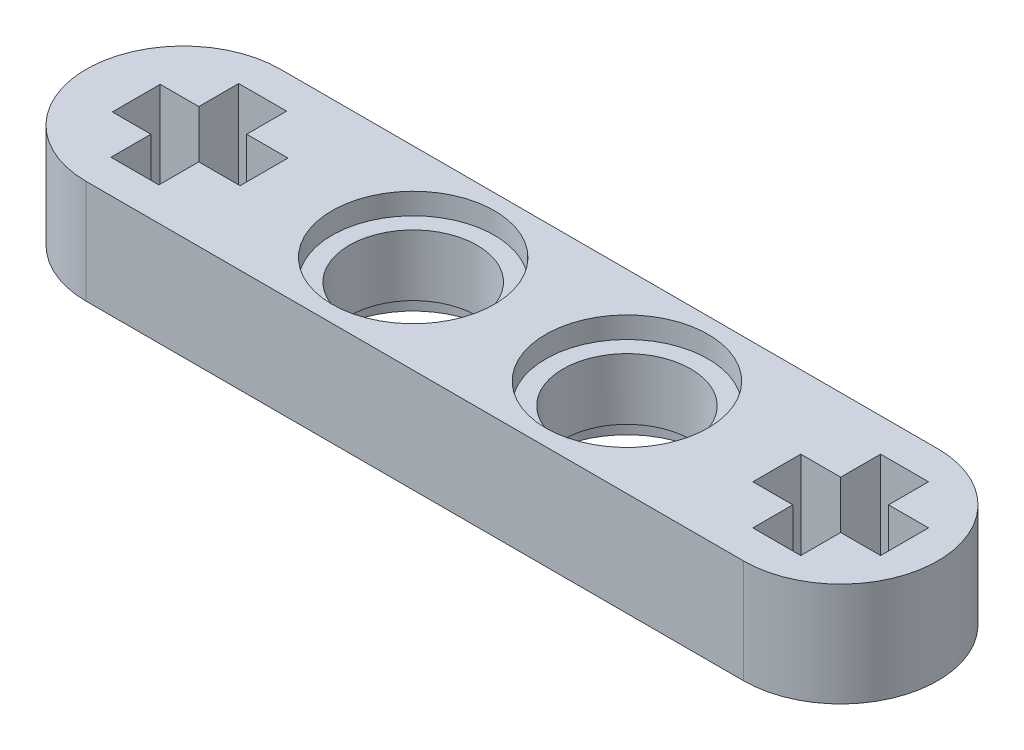
ISO-10303-21;
HEADER;
FILE_DESCRIPTION(('STEP AP214'),'2;1');
FILE_NAME('part.step','',(''),(''),'','','');
FILE_SCHEMA(('AUTOMOTIVE_DESIGN { 1 0 10303 214 1 1 1 1 }'));
ENDSEC;
DATA;
#1=APPLICATION_CONTEXT('core data for automotive mechanical design processes');
#2=APPLICATION_PROTOCOL_DEFINITION('international standard','automotive_design',2000,#1);
#3=PRODUCT_CONTEXT('',#1,'mechanical');
#4=PRODUCT('Part','Part','',(#3));
#5=PRODUCT_RELATED_PRODUCT_CATEGORY('part','',(#4));
#6=PRODUCT_DEFINITION_FORMATION('','',#4);
#7=PRODUCT_DEFINITION_CONTEXT('part definition',#1,'design');
#8=PRODUCT_DEFINITION('design','',#6,#7);
#9=PRODUCT_DEFINITION_SHAPE('','',#8);
#10=(LENGTH_UNIT() NAMED_UNIT(*) SI_UNIT(.MILLI.,.METRE.));
#11=(NAMED_UNIT(*) PLANE_ANGLE_UNIT() SI_UNIT($,.RADIAN.));
#12=(NAMED_UNIT(*) SI_UNIT($,.STERADIAN.) SOLID_ANGLE_UNIT());
#13=UNCERTAINTY_MEASURE_WITH_UNIT(LENGTH_MEASURE(1.E-05),#10,'distance_accuracy_value','');
#14=(GEOMETRIC_REPRESENTATION_CONTEXT(3) GLOBAL_UNCERTAINTY_ASSIGNED_CONTEXT((#13)) GLOBAL_UNIT_ASSIGNED_CONTEXT((#10,
#11,#12)) REPRESENTATION_CONTEXT('',''));
#15=CARTESIAN_POINT('',(0.,0.,0.));
#16=DIRECTION('',(0.,0.,1.));
#17=DIRECTION('',(1.,0.,0.));
#18=AXIS2_PLACEMENT_3D('',#15,#16,#17);
#19=CARTESIAN_POINT('',(-4.045,3.9,-0.0180082217721821));
#20=DIRECTION('',(0.,-1.,0.));
#21=DIRECTION('',(0.,0.,-1.));
#22=AXIS2_PLACEMENT_3D('',#19,#20,#21);
#23=CYLINDRICAL_SURFACE('',#22,2.4);
#24=CARTESIAN_POINT('',(-4.045,3.1,-0.0180082217721821));
#25=DIRECTION('',(0.,1.,0.));
#26=DIRECTION('',(0.,0.,1.));
#27=AXIS2_PLACEMENT_3D('',#24,#25,#26);
#28=CIRCLE('',#27,2.4);
#29=CARTESIAN_POINT('',(-4.045,3.1,2.38199177822782));
#30=VERTEX_POINT('',#29);
#31=EDGE_CURVE('E273',#30,#30,#28,.T.);
#32=ORIENTED_EDGE('',*,*,#31,.T.);
#33=EDGE_LOOP('',(#32));
#34=FACE_BOUND('',#33,.T.);
#35=CARTESIAN_POINT('',(-4.045,0.8,-0.0180082217721821));
#36=DIRECTION('',(0.,-1.,0.));
#37=DIRECTION('',(0.,0.,-1.));
#38=AXIS2_PLACEMENT_3D('',#35,#36,#37);
#39=CIRCLE('',#38,2.4);
#40=CARTESIAN_POINT('',(-4.045,0.8,-2.41800822177218));
#41=VERTEX_POINT('',#40);
#42=EDGE_CURVE('E43',#41,#41,#39,.T.);
#43=ORIENTED_EDGE('',*,*,#42,.T.);
#44=EDGE_LOOP('',(#43));
#45=FACE_BOUND('',#44,.T.);
#46=ADVANCED_FACE('F39',(#34,#45),#23,.F.);
#47=CARTESIAN_POINT('',(3.995,3.9,-0.00827061217611125));
#48=DIRECTION('',(0.,-1.,0.));
#49=DIRECTION('',(0.,0.,-1.));
#50=AXIS2_PLACEMENT_3D('',#47,#48,#49);
#51=CYLINDRICAL_SURFACE('',#50,2.4);
#52=CARTESIAN_POINT('',(3.995,3.1,-0.00827061217611125));
#53=DIRECTION('',(0.,1.,0.));
#54=DIRECTION('',(0.,0.,1.));
#55=AXIS2_PLACEMENT_3D('',#52,#53,#54);
#56=CIRCLE('',#55,2.4);
#57=CARTESIAN_POINT('',(3.995,3.1,2.39172938782389));
#58=VERTEX_POINT('',#57);
#59=EDGE_CURVE('E435',#58,#58,#56,.T.);
#60=ORIENTED_EDGE('',*,*,#59,.T.);
#61=EDGE_LOOP('',(#60));
#62=FACE_BOUND('',#61,.T.);
#63=CARTESIAN_POINT('',(3.995,0.8,-0.00827061217611125));
#64=DIRECTION('',(0.,-1.,0.));
#65=DIRECTION('',(0.,0.,-1.));
#66=AXIS2_PLACEMENT_3D('',#63,#64,#65);
#67=CIRCLE('',#66,2.4);
#68=CARTESIAN_POINT('',(3.995,0.8,-2.40827061217611));
#69=VERTEX_POINT('',#68);
#70=EDGE_CURVE('E440',#69,#69,#67,.T.);
#71=ORIENTED_EDGE('',*,*,#70,.T.);
#72=EDGE_LOOP('',(#71));
#73=FACE_BOUND('',#72,.T.);
#74=ADVANCED_FACE('F475',(#62,#73),#51,.F.);
#75=CARTESIAN_POINT('',(-12.665,3.9,0.));
#76=DIRECTION('',(0.,1.,0.));
#77=DIRECTION('',(0.,0.,1.));
#78=AXIS2_PLACEMENT_3D('',#75,#76,#77);
#79=PLANE('',#78);
#80=CARTESIAN_POINT('',(-4.045,3.9,-0.0180082217721821));
#81=DIRECTION('',(0.,1.,0.));
#82=DIRECTION('',(0.,0.,1.));
#83=AXIS2_PLACEMENT_3D('',#80,#81,#82);
#84=CIRCLE('',#83,3.05);
#85=CARTESIAN_POINT('',(-4.045,3.9,3.03199177822782));
#86=VERTEX_POINT('',#85);
#87=EDGE_CURVE('E463',#86,#86,#84,.T.);
#88=ORIENTED_EDGE('',*,*,#87,.F.);
#89=EDGE_LOOP('',(#88));
#90=FACE_BOUND('',#89,.T.);
#91=CARTESIAN_POINT('',(3.995,3.9,-0.00827061217611125));
#92=DIRECTION('',(0.,1.,0.));
#93=DIRECTION('',(0.,0.,1.));
#94=AXIS2_PLACEMENT_3D('',#91,#92,#93);
#95=CIRCLE('',#94,3.05);
#96=CARTESIAN_POINT('',(3.995,3.9,3.04172938782389));
#97=VERTEX_POINT('',#96);
#98=EDGE_CURVE('E446',#97,#97,#95,.T.);
#99=ORIENTED_EDGE('',*,*,#98,.F.);
#100=EDGE_LOOP('',(#99));
#101=FACE_BOUND('',#100,.T.);
#102=DIRECTION('',(1.,0.,0.));
#103=VECTOR('',#102,1.);
#104=CARTESIAN_POINT('',(-9.63306020227232,3.9,0.898912155858764));
#105=LINE('',#104,#103);
#106=CARTESIAN_POINT('',(-11.1849999999999,3.9,0.898912155858748));
#107=VERTEX_POINT('',#106);
#108=CARTESIAN_POINT('',(-9.63306020227232,3.9,0.898912155858764));
#109=VERTEX_POINT('',#108);
#110=EDGE_CURVE('E234',#107,#109,#105,.T.);
#111=ORIENTED_EDGE('',*,*,#110,.F.);
#112=DIRECTION('',(0.,0.,-1.));
#113=VECTOR('',#112,1.);
#114=CARTESIAN_POINT('',(-11.1849999999999,3.9,0.898912155858748));
#115=LINE('',#114,#113);
#116=CARTESIAN_POINT('',(-11.1849999999999,3.9,2.39891215586455));
#117=VERTEX_POINT('',#116);
#118=EDGE_CURVE('E226',#117,#107,#115,.T.);
#119=ORIENTED_EDGE('',*,*,#118,.F.);
#120=DIRECTION('',(1.,0.,0.));
#121=VECTOR('',#120,1.);
#122=CARTESIAN_POINT('',(-12.9850000000001,3.9,2.39891215586455));
#123=LINE('',#122,#121);
#124=CARTESIAN_POINT('',(-12.9850000000001,3.9,2.39891215586455));
#125=VERTEX_POINT('',#124);
#126=EDGE_CURVE('E270',#125,#117,#123,.T.);
#127=ORIENTED_EDGE('',*,*,#126,.F.);
#128=DIRECTION('',(0.,0.,1.));
#129=VECTOR('',#128,1.);
#130=CARTESIAN_POINT('',(-12.9850000000001,3.9,0.898912155858747));
#131=LINE('',#130,#129);
#132=CARTESIAN_POINT('',(-12.9850000000001,3.9,0.898912155858747));
#133=VERTEX_POINT('',#132);
#134=EDGE_CURVE('E268',#133,#125,#131,.T.);
#135=ORIENTED_EDGE('',*,*,#134,.F.);
#136=DIRECTION('',(1.,0.,0.));
#137=VECTOR('',#136,1.);
#138=CARTESIAN_POINT('',(-12.9850000000001,3.9,0.898912155858747));
#139=LINE('',#138,#137);
#140=CARTESIAN_POINT('',(-14.4330602022723,3.9,0.898912155858765));
#141=VERTEX_POINT('',#140);
#142=EDGE_CURVE('E266',#141,#133,#139,.T.);
#143=ORIENTED_EDGE('',*,*,#142,.F.);
#144=DIRECTION('',(0.,0.,1.));
#145=VECTOR('',#144,1.);
#146=CARTESIAN_POINT('',(-14.4330602022723,3.9,0.898912155858765));
#147=LINE('',#146,#145);
#148=CARTESIAN_POINT('',(-14.4330602022723,3.9,-0.901087844141502));
#149=VERTEX_POINT('',#148);
#150=EDGE_CURVE('E264',#149,#141,#147,.T.);
#151=ORIENTED_EDGE('',*,*,#150,.F.);
#152=DIRECTION('',(-1.,0.,0.));
#153=VECTOR('',#152,1.);
#154=CARTESIAN_POINT('',(-12.9850000000001,3.9,-0.901087844141502));
#155=LINE('',#154,#153);
#156=CARTESIAN_POINT('',(-12.9850000000001,3.9,-0.901087844141502));
#157=VERTEX_POINT('',#156);
#158=EDGE_CURVE('E262',#157,#149,#155,.T.);
#159=ORIENTED_EDGE('',*,*,#158,.F.);
#160=DIRECTION('',(0.,0.,1.));
#161=VECTOR('',#160,1.);
#162=CARTESIAN_POINT('',(-12.9850000000001,3.9,-2.40108784413312));
#163=LINE('',#162,#161);
#164=CARTESIAN_POINT('',(-12.9850000000001,3.9,-2.40108784413312));
#165=VERTEX_POINT('',#164);
#166=EDGE_CURVE('E260',#165,#157,#163,.T.);
#167=ORIENTED_EDGE('',*,*,#166,.F.);
#168=DIRECTION('',(-1.,0.,0.));
#169=VECTOR('',#168,1.);
#170=CARTESIAN_POINT('',(-12.9850000000001,3.9,-2.40108784413312));
#171=LINE('',#170,#169);
#172=CARTESIAN_POINT('',(-11.1849999999999,3.9,-2.40108784413312));
#173=VERTEX_POINT('',#172);
#174=EDGE_CURVE('E258',#173,#165,#171,.T.);
#175=ORIENTED_EDGE('',*,*,#174,.F.);
#176=DIRECTION('',(0.,0.,-1.));
#177=VECTOR('',#176,1.);
#178=CARTESIAN_POINT('',(-11.1849999999999,3.9,-2.40108784413312));
#179=LINE('',#178,#177);
#180=CARTESIAN_POINT('',(-11.1849999999999,3.9,-0.901087844141505));
#181=VERTEX_POINT('',#180);
#182=EDGE_CURVE('E256',#181,#173,#179,.T.);
#183=ORIENTED_EDGE('',*,*,#182,.F.);
#184=DIRECTION('',(-1.,0.,0.));
#185=VECTOR('',#184,1.);
#186=CARTESIAN_POINT('',(-9.63306020227232,3.9,-0.901087844141502));
#187=LINE('',#186,#185);
#188=CARTESIAN_POINT('',(-9.63306020227232,3.9,-0.901087844141502));
#189=VERTEX_POINT('',#188);
#190=EDGE_CURVE('E251',#189,#181,#187,.T.);
#191=ORIENTED_EDGE('',*,*,#190,.F.);
#192=DIRECTION('',(0.,0.,-1.));
#193=VECTOR('',#192,1.);
#194=CARTESIAN_POINT('',(-9.63306020227232,3.9,0.898912155858764));
#195=LINE('',#194,#193);
#196=EDGE_CURVE('E249',#109,#189,#195,.T.);
#197=ORIENTED_EDGE('',*,*,#196,.F.);
#198=EDGE_LOOP('',(#111,#119,#127,#135,#143,#151,#159,#167,#175,#183,#191,#197));
#199=FACE_BOUND('',#198,.T.);
#200=DIRECTION('',(1.,0.,0.));
#201=VECTOR('',#200,1.);
#202=CARTESIAN_POINT('',(14.435,3.9,0.9));
#203=LINE('',#202,#201);
#204=CARTESIAN_POINT('',(12.935,3.9,0.9));
#205=VERTEX_POINT('',#204);
#206=CARTESIAN_POINT('',(14.435,3.9,0.9));
#207=VERTEX_POINT('',#206);
#208=EDGE_CURVE('E325',#205,#207,#203,.T.);
#209=ORIENTED_EDGE('',*,*,#208,.F.);
#210=DIRECTION('',(0.,0.,-1.));
#211=VECTOR('',#210,1.);
#212=CARTESIAN_POINT('',(12.935,3.9,0.9));
#213=LINE('',#212,#211);
#214=CARTESIAN_POINT('',(12.935,3.9,2.4));
#215=VERTEX_POINT('',#214);
#216=EDGE_CURVE('E323',#215,#205,#213,.T.);
#217=ORIENTED_EDGE('',*,*,#216,.F.);
#218=DIRECTION('',(1.,0.,0.));
#219=VECTOR('',#218,1.);
#220=CARTESIAN_POINT('',(11.135,3.9,2.4));
#221=LINE('',#220,#219);
#222=CARTESIAN_POINT('',(11.135,3.9,2.4));
#223=VERTEX_POINT('',#222);
#224=EDGE_CURVE('E347',#223,#215,#221,.T.);
#225=ORIENTED_EDGE('',*,*,#224,.F.);
#226=DIRECTION('',(0.,0.,1.));
#227=VECTOR('',#226,1.);
#228=CARTESIAN_POINT('',(11.135,3.9,0.9));
#229=LINE('',#228,#227);
#230=CARTESIAN_POINT('',(11.135,3.9,0.9));
#231=VERTEX_POINT('',#230);
#232=EDGE_CURVE('E344',#231,#223,#229,.T.);
#233=ORIENTED_EDGE('',*,*,#232,.F.);
#234=DIRECTION('',(1.,0.,0.));
#235=VECTOR('',#234,1.);
#236=CARTESIAN_POINT('',(11.135,3.9,0.9));
#237=LINE('',#236,#235);
#238=CARTESIAN_POINT('',(9.63499999999998,3.9,0.900000000000001));
#239=VERTEX_POINT('',#238);
#240=EDGE_CURVE('E342',#239,#231,#237,.T.);
#241=ORIENTED_EDGE('',*,*,#240,.F.);
#242=DIRECTION('',(0.,0.,1.));
#243=VECTOR('',#242,1.);
#244=CARTESIAN_POINT('',(9.63499999999998,3.9,0.900000000000001));
#245=LINE('',#244,#243);
#246=CARTESIAN_POINT('',(9.63500000000002,3.9,-0.9));
#247=VERTEX_POINT('',#246);
#248=EDGE_CURVE('E340',#247,#239,#245,.T.);
#249=ORIENTED_EDGE('',*,*,#248,.F.);
#250=DIRECTION('',(-1.,0.,0.));
#251=VECTOR('',#250,1.);
#252=CARTESIAN_POINT('',(11.135,3.9,-0.900000000000001));
#253=LINE('',#252,#251);
#254=CARTESIAN_POINT('',(11.135,3.9,-0.900000000000001));
#255=VERTEX_POINT('',#254);
#256=EDGE_CURVE('E338',#255,#247,#253,.T.);
#257=ORIENTED_EDGE('',*,*,#256,.F.);
#258=DIRECTION('',(0.,0.,1.));
#259=VECTOR('',#258,1.);
#260=CARTESIAN_POINT('',(11.135,3.9,-2.4));
#261=LINE('',#260,#259);
#262=CARTESIAN_POINT('',(11.135,3.9,-2.4));
#263=VERTEX_POINT('',#262);
#264=EDGE_CURVE('E336',#263,#255,#261,.T.);
#265=ORIENTED_EDGE('',*,*,#264,.F.);
#266=DIRECTION('',(-1.,0.,0.));
#267=VECTOR('',#266,1.);
#268=CARTESIAN_POINT('',(11.135,3.9,-2.4));
#269=LINE('',#268,#267);
#270=CARTESIAN_POINT('',(12.935,3.9,-2.4));
#271=VERTEX_POINT('',#270);
#272=EDGE_CURVE('E334',#271,#263,#269,.T.);
#273=ORIENTED_EDGE('',*,*,#272,.F.);
#274=DIRECTION('',(0.,0.,-1.));
#275=VECTOR('',#274,1.);
#276=CARTESIAN_POINT('',(12.935,3.9,-2.4));
#277=LINE('',#276,#275);
#278=CARTESIAN_POINT('',(12.935,3.9,-0.900000000000002));
#279=VERTEX_POINT('',#278);
#280=EDGE_CURVE('E332',#279,#271,#277,.T.);
#281=ORIENTED_EDGE('',*,*,#280,.F.);
#282=DIRECTION('',(-1.,0.,0.));
#283=VECTOR('',#282,1.);
#284=CARTESIAN_POINT('',(14.435,3.9,-0.900000000000003));
#285=LINE('',#284,#283);
#286=CARTESIAN_POINT('',(14.435,3.9,-0.900000000000003));
#287=VERTEX_POINT('',#286);
#288=EDGE_CURVE('E330',#287,#279,#285,.T.);
#289=ORIENTED_EDGE('',*,*,#288,.F.);
#290=DIRECTION('',(0.,0.,-1.));
#291=VECTOR('',#290,1.);
#292=CARTESIAN_POINT('',(14.435,3.9,0.9));
#293=LINE('',#292,#291);
#294=EDGE_CURVE('E328',#207,#287,#293,.T.);
#295=ORIENTED_EDGE('',*,*,#294,.F.);
#296=EDGE_LOOP('',(#209,#217,#225,#233,#241,#249,#257,#265,#273,#281,#289,#295));
#297=FACE_BOUND('',#296,.T.);
#298=CARTESIAN_POINT('',(-12.665,3.9,0.));
#299=DIRECTION('',(0.,1.,0.));
#300=DIRECTION('',(0.,0.,1.));
#301=AXIS2_PLACEMENT_3D('',#298,#299,#300);
#302=CIRCLE('',#301,3.65);
#303=CARTESIAN_POINT('',(-12.665,3.9,-3.65));
#304=VERTEX_POINT('',#303);
#305=CARTESIAN_POINT('',(-12.665,3.9,3.65));
#306=VERTEX_POINT('',#305);
#307=EDGE_CURVE('E410',#304,#306,#302,.T.);
#308=ORIENTED_EDGE('',*,*,#307,.T.);
#309=DIRECTION('',(1.,0.,0.));
#310=VECTOR('',#309,1.);
#311=CARTESIAN_POINT('',(-12.665,3.9,3.65));
#312=LINE('',#311,#310);
#313=CARTESIAN_POINT('',(12.035,3.9,3.65));
#314=VERTEX_POINT('',#313);
#315=EDGE_CURVE('E413',#306,#314,#312,.T.);
#316=ORIENTED_EDGE('',*,*,#315,.T.);
#317=CARTESIAN_POINT('',(12.035,3.9,0.));
#318=DIRECTION('',(0.,1.,0.));
#319=DIRECTION('',(0.,0.,1.));
#320=AXIS2_PLACEMENT_3D('',#317,#318,#319);
#321=CIRCLE('',#320,3.65);
#322=CARTESIAN_POINT('',(12.035,3.9,-3.65));
#323=VERTEX_POINT('',#322);
#324=EDGE_CURVE('E416',#314,#323,#321,.T.);
#325=ORIENTED_EDGE('',*,*,#324,.T.);
#326=DIRECTION('',(-1.,0.,0.));
#327=VECTOR('',#326,1.);
#328=CARTESIAN_POINT('',(-12.665,3.9,-3.65));
#329=LINE('',#328,#327);
#330=EDGE_CURVE('E418',#323,#304,#329,.T.);
#331=ORIENTED_EDGE('',*,*,#330,.T.);
#332=EDGE_LOOP('',(#308,#316,#325,#331));
#333=FACE_BOUND('',#332,.T.);
#334=ADVANCED_FACE('F246',(#90,#101,#199,#297,#333),#79,.T.);
#335=CARTESIAN_POINT('',(-12.665,0.,0.));
#336=DIRECTION('',(0.,1.,0.));
#337=DIRECTION('',(0.,0.,1.));
#338=AXIS2_PLACEMENT_3D('',#335,#336,#337);
#339=PLANE('',#338);
#340=CARTESIAN_POINT('',(3.995,0.,-0.00827061217611125));
#341=DIRECTION('',(0.,-1.,0.));
#342=DIRECTION('',(0.,0.,-1.));
#343=AXIS2_PLACEMENT_3D('',#340,#341,#342);
#344=CIRCLE('',#343,3.05);
#345=CARTESIAN_POINT('',(3.995,0.,-3.05827061217611));
#346=VERTEX_POINT('',#345);
#347=EDGE_CURVE('E448',#346,#346,#344,.T.);
#348=ORIENTED_EDGE('',*,*,#347,.F.);
#349=EDGE_LOOP('',(#348));
#350=FACE_BOUND('',#349,.T.);
#351=CARTESIAN_POINT('',(-4.045,0.,-0.0180082217721821));
#352=DIRECTION('',(0.,-1.,0.));
#353=DIRECTION('',(0.,0.,-1.));
#354=AXIS2_PLACEMENT_3D('',#351,#352,#353);
#355=CIRCLE('',#354,3.05);
#356=CARTESIAN_POINT('',(-4.045,0.,-3.06800822177218));
#357=VERTEX_POINT('',#356);
#358=EDGE_CURVE('E458',#357,#357,#355,.T.);
#359=ORIENTED_EDGE('',*,*,#358,.F.);
#360=EDGE_LOOP('',(#359));
#361=FACE_BOUND('',#360,.T.);
#362=DIRECTION('',(0.,0.,-1.));
#363=VECTOR('',#362,1.);
#364=CARTESIAN_POINT('',(12.935,0.,0.9));
#365=LINE('',#364,#363);
#366=CARTESIAN_POINT('',(12.935,0.,2.4));
#367=VERTEX_POINT('',#366);
#368=CARTESIAN_POINT('',(12.935,0.,0.9));
#369=VERTEX_POINT('',#368);
#370=EDGE_CURVE('E242',#367,#369,#365,.T.);
#371=ORIENTED_EDGE('',*,*,#370,.T.);
#372=DIRECTION('',(1.,0.,0.));
#373=VECTOR('',#372,1.);
#374=CARTESIAN_POINT('',(14.435,0.,0.9));
#375=LINE('',#374,#373);
#376=CARTESIAN_POINT('',(14.435,0.,0.9));
#377=VERTEX_POINT('',#376);
#378=EDGE_CURVE('E352',#369,#377,#375,.T.);
#379=ORIENTED_EDGE('',*,*,#378,.T.);
#380=DIRECTION('',(0.,0.,-1.));
#381=VECTOR('',#380,1.);
#382=CARTESIAN_POINT('',(14.435,0.,0.9));
#383=LINE('',#382,#381);
#384=CARTESIAN_POINT('',(14.435,0.,-0.900000000000003));
#385=VERTEX_POINT('',#384);
#386=EDGE_CURVE('E355',#377,#385,#383,.T.);
#387=ORIENTED_EDGE('',*,*,#386,.T.);
#388=DIRECTION('',(-1.,0.,0.));
#389=VECTOR('',#388,1.);
#390=CARTESIAN_POINT('',(14.435,0.,-0.900000000000003));
#391=LINE('',#390,#389);
#392=CARTESIAN_POINT('',(12.935,0.,-0.900000000000002));
#393=VERTEX_POINT('',#392);
#394=EDGE_CURVE('E358',#385,#393,#391,.T.);
#395=ORIENTED_EDGE('',*,*,#394,.T.);
#396=DIRECTION('',(0.,0.,-1.));
#397=VECTOR('',#396,1.);
#398=CARTESIAN_POINT('',(12.935,0.,-2.4));
#399=LINE('',#398,#397);
#400=CARTESIAN_POINT('',(12.935,0.,-2.4));
#401=VERTEX_POINT('',#400);
#402=EDGE_CURVE('E361',#393,#401,#399,.T.);
#403=ORIENTED_EDGE('',*,*,#402,.T.);
#404=DIRECTION('',(-1.,0.,0.));
#405=VECTOR('',#404,1.);
#406=CARTESIAN_POINT('',(11.135,0.,-2.4));
#407=LINE('',#406,#405);
#408=CARTESIAN_POINT('',(11.135,0.,-2.4));
#409=VERTEX_POINT('',#408);
#410=EDGE_CURVE('E364',#401,#409,#407,.T.);
#411=ORIENTED_EDGE('',*,*,#410,.T.);
#412=DIRECTION('',(0.,0.,1.));
#413=VECTOR('',#412,1.);
#414=CARTESIAN_POINT('',(11.135,0.,-2.4));
#415=LINE('',#414,#413);
#416=CARTESIAN_POINT('',(11.135,0.,-0.900000000000001));
#417=VERTEX_POINT('',#416);
#418=EDGE_CURVE('E367',#409,#417,#415,.T.);
#419=ORIENTED_EDGE('',*,*,#418,.T.);
#420=DIRECTION('',(-1.,0.,0.));
#421=VECTOR('',#420,1.);
#422=CARTESIAN_POINT('',(11.135,0.,-0.900000000000001));
#423=LINE('',#422,#421);
#424=CARTESIAN_POINT('',(9.63500000000002,0.,-0.9));
#425=VERTEX_POINT('',#424);
#426=EDGE_CURVE('E370',#417,#425,#423,.T.);
#427=ORIENTED_EDGE('',*,*,#426,.T.);
#428=DIRECTION('',(0.,0.,1.));
#429=VECTOR('',#428,1.);
#430=CARTESIAN_POINT('',(9.63499999999998,0.,0.900000000000001));
#431=LINE('',#430,#429);
#432=CARTESIAN_POINT('',(9.63499999999998,0.,0.900000000000001));
#433=VERTEX_POINT('',#432);
#434=EDGE_CURVE('E373',#425,#433,#431,.T.);
#435=ORIENTED_EDGE('',*,*,#434,.T.);
#436=DIRECTION('',(1.,0.,0.));
#437=VECTOR('',#436,1.);
#438=CARTESIAN_POINT('',(11.135,0.,0.9));
#439=LINE('',#438,#437);
#440=CARTESIAN_POINT('',(11.135,0.,0.9));
#441=VERTEX_POINT('',#440);
#442=EDGE_CURVE('E376',#433,#441,#439,.T.);
#443=ORIENTED_EDGE('',*,*,#442,.T.);
#444=DIRECTION('',(0.,0.,1.));
#445=VECTOR('',#444,1.);
#446=CARTESIAN_POINT('',(11.135,0.,0.9));
#447=LINE('',#446,#445);
#448=CARTESIAN_POINT('',(11.135,0.,2.4));
#449=VERTEX_POINT('',#448);
#450=EDGE_CURVE('E379',#441,#449,#447,.T.);
#451=ORIENTED_EDGE('',*,*,#450,.T.);
#452=DIRECTION('',(1.,0.,0.));
#453=VECTOR('',#452,1.);
#454=CARTESIAN_POINT('',(11.135,0.,2.4));
#455=LINE('',#454,#453);
#456=EDGE_CURVE('E326',#449,#367,#455,.T.);
#457=ORIENTED_EDGE('',*,*,#456,.T.);
#458=EDGE_LOOP('',(#371,#379,#387,#395,#403,#411,#419,#427,#435,#443,#451,#457));
#459=FACE_BOUND('',#458,.T.);
#460=CARTESIAN_POINT('',(-12.665,0.,0.));
#461=DIRECTION('',(0.,1.,0.));
#462=DIRECTION('',(0.,0.,1.));
#463=AXIS2_PLACEMENT_3D('',#460,#461,#462);
#464=CIRCLE('',#463,3.65);
#465=CARTESIAN_POINT('',(-12.665,0.,-3.65));
#466=VERTEX_POINT('',#465);
#467=CARTESIAN_POINT('',(-12.665,0.,3.65));
#468=VERTEX_POINT('',#467);
#469=EDGE_CURVE('E409',#466,#468,#464,.T.);
#470=ORIENTED_EDGE('',*,*,#469,.F.);
#471=DIRECTION('',(-1.,0.,0.));
#472=VECTOR('',#471,1.);
#473=CARTESIAN_POINT('',(-12.665,0.,-3.65));
#474=LINE('',#473,#472);
#475=CARTESIAN_POINT('',(12.035,0.,-3.65));
#476=VERTEX_POINT('',#475);
#477=EDGE_CURVE('E414',#476,#466,#474,.T.);
#478=ORIENTED_EDGE('',*,*,#477,.F.);
#479=CARTESIAN_POINT('',(12.035,0.,0.));
#480=DIRECTION('',(0.,1.,0.));
#481=DIRECTION('',(0.,0.,1.));
#482=AXIS2_PLACEMENT_3D('',#479,#480,#481);
#483=CIRCLE('',#482,3.65);
#484=CARTESIAN_POINT('',(12.035,0.,3.65));
#485=VERTEX_POINT('',#484);
#486=EDGE_CURVE('E425',#485,#476,#483,.T.);
#487=ORIENTED_EDGE('',*,*,#486,.F.);
#488=DIRECTION('',(1.,0.,0.));
#489=VECTOR('',#488,1.);
#490=CARTESIAN_POINT('',(-12.665,0.,3.65));
#491=LINE('',#490,#489);
#492=EDGE_CURVE('E423',#468,#485,#491,.T.);
#493=ORIENTED_EDGE('',*,*,#492,.F.);
#494=EDGE_LOOP('',(#470,#478,#487,#493));
#495=FACE_BOUND('',#494,.T.);
#496=DIRECTION('',(0.,0.,-1.));
#497=VECTOR('',#496,1.);
#498=CARTESIAN_POINT('',(-11.1849999999999,0.,0.898912155858748));
#499=LINE('',#498,#497);
#500=CARTESIAN_POINT('',(-11.1849999999999,0.,2.39891215586455));
#501=VERTEX_POINT('',#500);
#502=CARTESIAN_POINT('',(-11.1849999999999,0.,0.898912155858748));
#503=VERTEX_POINT('',#502);
#504=EDGE_CURVE('E64',#501,#503,#499,.T.);
#505=ORIENTED_EDGE('',*,*,#504,.T.);
#506=DIRECTION('',(1.,0.,0.));
#507=VECTOR('',#506,1.);
#508=CARTESIAN_POINT('',(-9.63306020227232,0.,0.898912155858764));
#509=LINE('',#508,#507);
#510=CARTESIAN_POINT('',(-9.63306020227232,0.,0.898912155858764));
#511=VERTEX_POINT('',#510);
#512=EDGE_CURVE('E241',#503,#511,#509,.T.);
#513=ORIENTED_EDGE('',*,*,#512,.T.);
#514=DIRECTION('',(0.,0.,-1.));
#515=VECTOR('',#514,1.);
#516=CARTESIAN_POINT('',(-9.63306020227232,0.,0.898912155858764));
#517=LINE('',#516,#515);
#518=CARTESIAN_POINT('',(-9.63306020227232,0.,-0.901087844141502));
#519=VERTEX_POINT('',#518);
#520=EDGE_CURVE('E275',#511,#519,#517,.T.);
#521=ORIENTED_EDGE('',*,*,#520,.T.);
#522=DIRECTION('',(-1.,0.,0.));
#523=VECTOR('',#522,1.);
#524=CARTESIAN_POINT('',(-9.63306020227232,0.,-0.901087844141502));
#525=LINE('',#524,#523);
#526=CARTESIAN_POINT('',(-11.1849999999999,0.,-0.901087844141505));
#527=VERTEX_POINT('',#526);
#528=EDGE_CURVE('E278',#519,#527,#525,.T.);
#529=ORIENTED_EDGE('',*,*,#528,.T.);
#530=DIRECTION('',(0.,0.,-1.));
#531=VECTOR('',#530,1.);
#532=CARTESIAN_POINT('',(-11.1849999999999,0.,-2.40108784413312));
#533=LINE('',#532,#531);
#534=CARTESIAN_POINT('',(-11.1849999999999,0.,-2.40108784413312));
#535=VERTEX_POINT('',#534);
#536=EDGE_CURVE('E281',#527,#535,#533,.T.);
#537=ORIENTED_EDGE('',*,*,#536,.T.);
#538=DIRECTION('',(-1.,0.,0.));
#539=VECTOR('',#538,1.);
#540=CARTESIAN_POINT('',(-12.9850000000001,0.,-2.40108784413312));
#541=LINE('',#540,#539);
#542=CARTESIAN_POINT('',(-12.9850000000001,0.,-2.40108784413312));
#543=VERTEX_POINT('',#542);
#544=EDGE_CURVE('E284',#535,#543,#541,.T.);
#545=ORIENTED_EDGE('',*,*,#544,.T.);
#546=DIRECTION('',(0.,0.,1.));
#547=VECTOR('',#546,1.);
#548=CARTESIAN_POINT('',(-12.9850000000001,0.,-2.40108784413312));
#549=LINE('',#548,#547);
#550=CARTESIAN_POINT('',(-12.9850000000001,0.,-0.901087844141502));
#551=VERTEX_POINT('',#550);
#552=EDGE_CURVE('E287',#543,#551,#549,.T.);
#553=ORIENTED_EDGE('',*,*,#552,.T.);
#554=DIRECTION('',(-1.,0.,0.));
#555=VECTOR('',#554,1.);
#556=CARTESIAN_POINT('',(-12.9850000000001,0.,-0.901087844141502));
#557=LINE('',#556,#555);
#558=CARTESIAN_POINT('',(-14.4330602022723,0.,-0.901087844141502));
#559=VERTEX_POINT('',#558);
#560=EDGE_CURVE('E290',#551,#559,#557,.T.);
#561=ORIENTED_EDGE('',*,*,#560,.T.);
#562=DIRECTION('',(0.,0.,1.));
#563=VECTOR('',#562,1.);
#564=CARTESIAN_POINT('',(-14.4330602022723,0.,0.898912155858765));
#565=LINE('',#564,#563);
#566=CARTESIAN_POINT('',(-14.4330602022723,0.,0.898912155858765));
#567=VERTEX_POINT('',#566);
#568=EDGE_CURVE('E293',#559,#567,#565,.T.);
#569=ORIENTED_EDGE('',*,*,#568,.T.);
#570=DIRECTION('',(1.,0.,0.));
#571=VECTOR('',#570,1.);
#572=CARTESIAN_POINT('',(-12.9850000000001,0.,0.898912155858747));
#573=LINE('',#572,#571);
#574=CARTESIAN_POINT('',(-12.9850000000001,0.,0.898912155858747));
#575=VERTEX_POINT('',#574);
#576=EDGE_CURVE('E296',#567,#575,#573,.T.);
#577=ORIENTED_EDGE('',*,*,#576,.T.);
#578=DIRECTION('',(0.,0.,1.));
#579=VECTOR('',#578,1.);
#580=CARTESIAN_POINT('',(-12.9850000000001,0.,0.898912155858747));
#581=LINE('',#580,#579);
#582=CARTESIAN_POINT('',(-12.9850000000001,0.,2.39891215586455));
#583=VERTEX_POINT('',#582);
#584=EDGE_CURVE('E299',#575,#583,#581,.T.);
#585=ORIENTED_EDGE('',*,*,#584,.T.);
#586=DIRECTION('',(1.,0.,0.));
#587=VECTOR('',#586,1.);
#588=CARTESIAN_POINT('',(-12.9850000000001,0.,2.39891215586455));
#589=LINE('',#588,#587);
#590=EDGE_CURVE('E235',#583,#501,#589,.T.);
#591=ORIENTED_EDGE('',*,*,#590,.T.);
#592=EDGE_LOOP('',(#505,#513,#521,#529,#537,#545,#553,#561,#569,#577,#585,#591));
#593=FACE_BOUND('',#592,.T.);
#594=ADVANCED_FACE('F474',(#350,#361,#459,#495,#593),#339,.F.);
#595=CARTESIAN_POINT('',(-12.665,3.9,0.));
#596=DIRECTION('',(0.,-1.,0.));
#597=DIRECTION('',(0.,0.,-1.));
#598=AXIS2_PLACEMENT_3D('',#595,#596,#597);
#599=CYLINDRICAL_SURFACE('',#598,3.65);
#600=ORIENTED_EDGE('',*,*,#469,.T.);
#601=DIRECTION('',(0.,-1.,0.));
#602=VECTOR('',#601,1.);
#603=CARTESIAN_POINT('',(-12.665,3.9,3.65));
#604=LINE('',#603,#602);
#605=EDGE_CURVE('E11',#306,#468,#604,.T.);
#606=ORIENTED_EDGE('',*,*,#605,.F.);
#607=ORIENTED_EDGE('',*,*,#307,.F.);
#608=DIRECTION('',(0.,-1.,0.));
#609=VECTOR('',#608,1.);
#610=CARTESIAN_POINT('',(-12.665,3.9,-3.65));
#611=LINE('',#610,#609);
#612=EDGE_CURVE('E420',#304,#466,#611,.T.);
#613=ORIENTED_EDGE('',*,*,#612,.T.);
#614=EDGE_LOOP('',(#600,#606,#607,#613));
#615=FACE_BOUND('',#614,.T.);
#616=ADVANCED_FACE('F41',(#615),#599,.T.);
#617=CARTESIAN_POINT('',(-12.665,3.9,3.65));
#618=DIRECTION('',(0.,0.,-1.));
#619=DIRECTION('',(-1.,0.,0.));
#620=AXIS2_PLACEMENT_3D('',#617,#618,#619);
#621=PLANE('',#620);
#622=ORIENTED_EDGE('',*,*,#492,.T.);
#623=DIRECTION('',(0.,-1.,0.));
#624=VECTOR('',#623,1.);
#625=CARTESIAN_POINT('',(12.035,3.9,3.65));
#626=LINE('',#625,#624);
#627=EDGE_CURVE('E48',#314,#485,#626,.T.);
#628=ORIENTED_EDGE('',*,*,#627,.F.);
#629=ORIENTED_EDGE('',*,*,#315,.F.);
#630=ORIENTED_EDGE('',*,*,#605,.T.);
#631=EDGE_LOOP('',(#622,#628,#629,#630));
#632=FACE_BOUND('',#631,.T.);
#633=ADVANCED_FACE('F758',(#632),#621,.F.);
#634=CARTESIAN_POINT('',(12.035,3.9,0.));
#635=DIRECTION('',(0.,-1.,0.));
#636=DIRECTION('',(0.,0.,-1.));
#637=AXIS2_PLACEMENT_3D('',#634,#635,#636);
#638=CYLINDRICAL_SURFACE('',#637,3.65);
#639=ORIENTED_EDGE('',*,*,#486,.T.);
#640=DIRECTION('',(0.,-1.,0.));
#641=VECTOR('',#640,1.);
#642=CARTESIAN_POINT('',(12.035,3.9,-3.65));
#643=LINE('',#642,#641);
#644=EDGE_CURVE('E430',#323,#476,#643,.T.);
#645=ORIENTED_EDGE('',*,*,#644,.F.);
#646=ORIENTED_EDGE('',*,*,#324,.F.);
#647=ORIENTED_EDGE('',*,*,#627,.T.);
#648=EDGE_LOOP('',(#639,#645,#646,#647));
#649=FACE_BOUND('',#648,.T.);
#650=ADVANCED_FACE('F751',(#649),#638,.T.);
#651=CARTESIAN_POINT('',(-12.665,3.9,-3.65));
#652=DIRECTION('',(0.,0.,1.));
#653=DIRECTION('',(1.,0.,0.));
#654=AXIS2_PLACEMENT_3D('',#651,#652,#653);
#655=PLANE('',#654);
#656=ORIENTED_EDGE('',*,*,#477,.T.);
#657=ORIENTED_EDGE('',*,*,#612,.F.);
#658=ORIENTED_EDGE('',*,*,#330,.F.);
#659=ORIENTED_EDGE('',*,*,#644,.T.);
#660=EDGE_LOOP('',(#656,#657,#658,#659));
#661=FACE_BOUND('',#660,.T.);
#662=ADVANCED_FACE('F498',(#661),#655,.F.);
#663=CARTESIAN_POINT('',(12.935,3.9,0.9));
#664=DIRECTION('',(-1.,0.,0.));
#665=DIRECTION('',(0.,0.,1.));
#666=AXIS2_PLACEMENT_3D('',#663,#664,#665);
#667=PLANE('',#666);
#668=ORIENTED_EDGE('',*,*,#370,.F.);
#669=DIRECTION('',(0.,-1.,0.));
#670=VECTOR('',#669,1.);
#671=CARTESIAN_POINT('',(12.935,3.9,2.4));
#672=LINE('',#671,#670);
#673=EDGE_CURVE('E349',#215,#367,#672,.T.);
#674=ORIENTED_EDGE('',*,*,#673,.F.);
#675=ORIENTED_EDGE('',*,*,#216,.T.);
#676=DIRECTION('',(0.,-1.,0.));
#677=VECTOR('',#676,1.);
#678=CARTESIAN_POINT('',(12.935,3.9,0.9));
#679=LINE('',#678,#677);
#680=EDGE_CURVE('E406',#205,#369,#679,.T.);
#681=ORIENTED_EDGE('',*,*,#680,.T.);
#682=EDGE_LOOP('',(#668,#674,#675,#681));
#683=FACE_BOUND('',#682,.T.);
#684=ADVANCED_FACE('F494',(#683),#667,.T.);
#685=CARTESIAN_POINT('',(14.435,3.9,0.9));
#686=DIRECTION('',(0.,0.,-1.));
#687=DIRECTION('',(-1.,0.,0.));
#688=AXIS2_PLACEMENT_3D('',#685,#686,#687);
#689=PLANE('',#688);
#690=ORIENTED_EDGE('',*,*,#378,.F.);
#691=ORIENTED_EDGE('',*,*,#680,.F.);
#692=ORIENTED_EDGE('',*,*,#208,.T.);
#693=DIRECTION('',(0.,-1.,0.));
#694=VECTOR('',#693,1.);
#695=CARTESIAN_POINT('',(14.435,3.9,0.9));
#696=LINE('',#695,#694);
#697=EDGE_CURVE('E404',#207,#377,#696,.T.);
#698=ORIENTED_EDGE('',*,*,#697,.T.);
#699=EDGE_LOOP('',(#690,#691,#692,#698));
#700=FACE_BOUND('',#699,.T.);
#701=ADVANCED_FACE('F497',(#700),#689,.T.);
#702=CARTESIAN_POINT('',(14.435,3.9,0.9));
#703=DIRECTION('',(-1.,0.,0.));
#704=DIRECTION('',(0.,0.,1.));
#705=AXIS2_PLACEMENT_3D('',#702,#703,#704);
#706=PLANE('',#705);
#707=ORIENTED_EDGE('',*,*,#386,.F.);
#708=ORIENTED_EDGE('',*,*,#697,.F.);
#709=ORIENTED_EDGE('',*,*,#294,.T.);
#710=DIRECTION('',(0.,-1.,0.));
#711=VECTOR('',#710,1.);
#712=CARTESIAN_POINT('',(14.435,3.9,-0.900000000000003));
#713=LINE('',#712,#711);
#714=EDGE_CURVE('E402',#287,#385,#713,.T.);
#715=ORIENTED_EDGE('',*,*,#714,.T.);
#716=EDGE_LOOP('',(#707,#708,#709,#715));
#717=FACE_BOUND('',#716,.T.);
#718=ADVANCED_FACE('F502',(#717),#706,.T.);
#719=CARTESIAN_POINT('',(14.435,3.9,-0.900000000000003));
#720=DIRECTION('',(0.,0.,1.));
#721=DIRECTION('',(1.,0.,0.));
#722=AXIS2_PLACEMENT_3D('',#719,#720,#721);
#723=PLANE('',#722);
#724=ORIENTED_EDGE('',*,*,#394,.F.);
#725=ORIENTED_EDGE('',*,*,#714,.F.);
#726=ORIENTED_EDGE('',*,*,#288,.T.);
#727=DIRECTION('',(0.,-1.,0.));
#728=VECTOR('',#727,1.);
#729=CARTESIAN_POINT('',(12.935,3.9,-0.900000000000002));
#730=LINE('',#729,#728);
#731=EDGE_CURVE('E400',#279,#393,#730,.T.);
#732=ORIENTED_EDGE('',*,*,#731,.T.);
#733=EDGE_LOOP('',(#724,#725,#726,#732));
#734=FACE_BOUND('',#733,.T.);
#735=ADVANCED_FACE('F506',(#734),#723,.T.);
#736=CARTESIAN_POINT('',(12.935,3.9,-2.4));
#737=DIRECTION('',(-1.,0.,0.));
#738=DIRECTION('',(0.,0.,1.));
#739=AXIS2_PLACEMENT_3D('',#736,#737,#738);
#740=PLANE('',#739);
#741=ORIENTED_EDGE('',*,*,#402,.F.);
#742=ORIENTED_EDGE('',*,*,#731,.F.);
#743=ORIENTED_EDGE('',*,*,#280,.T.);
#744=DIRECTION('',(0.,-1.,0.));
#745=VECTOR('',#744,1.);
#746=CARTESIAN_POINT('',(12.935,3.9,-2.4));
#747=LINE('',#746,#745);
#748=EDGE_CURVE('E398',#271,#401,#747,.T.);
#749=ORIENTED_EDGE('',*,*,#748,.T.);
#750=EDGE_LOOP('',(#741,#742,#743,#749));
#751=FACE_BOUND('',#750,.T.);
#752=ADVANCED_FACE('F510',(#751),#740,.T.);
#753=CARTESIAN_POINT('',(11.135,3.9,-2.4));
#754=DIRECTION('',(0.,0.,1.));
#755=DIRECTION('',(1.,0.,0.));
#756=AXIS2_PLACEMENT_3D('',#753,#754,#755);
#757=PLANE('',#756);
#758=ORIENTED_EDGE('',*,*,#410,.F.);
#759=ORIENTED_EDGE('',*,*,#748,.F.);
#760=ORIENTED_EDGE('',*,*,#272,.T.);
#761=DIRECTION('',(0.,-1.,0.));
#762=VECTOR('',#761,1.);
#763=CARTESIAN_POINT('',(11.135,3.9,-2.4));
#764=LINE('',#763,#762);
#765=EDGE_CURVE('E396',#263,#409,#764,.T.);
#766=ORIENTED_EDGE('',*,*,#765,.T.);
#767=EDGE_LOOP('',(#758,#759,#760,#766));
#768=FACE_BOUND('',#767,.T.);
#769=ADVANCED_FACE('F514',(#768),#757,.T.);
#770=CARTESIAN_POINT('',(11.135,3.9,-2.4));
#771=DIRECTION('',(1.,0.,0.));
#772=DIRECTION('',(0.,0.,-1.));
#773=AXIS2_PLACEMENT_3D('',#770,#771,#772);
#774=PLANE('',#773);
#775=ORIENTED_EDGE('',*,*,#418,.F.);
#776=ORIENTED_EDGE('',*,*,#765,.F.);
#777=ORIENTED_EDGE('',*,*,#264,.T.);
#778=DIRECTION('',(0.,-1.,0.));
#779=VECTOR('',#778,1.);
#780=CARTESIAN_POINT('',(11.135,3.9,-0.900000000000001));
#781=LINE('',#780,#779);
#782=EDGE_CURVE('E394',#255,#417,#781,.T.);
#783=ORIENTED_EDGE('',*,*,#782,.T.);
#784=EDGE_LOOP('',(#775,#776,#777,#783));
#785=FACE_BOUND('',#784,.T.);
#786=ADVANCED_FACE('F518',(#785),#774,.T.);
#787=CARTESIAN_POINT('',(11.135,3.9,-0.900000000000001));
#788=DIRECTION('',(0.,0.,1.));
#789=DIRECTION('',(1.,0.,0.));
#790=AXIS2_PLACEMENT_3D('',#787,#788,#789);
#791=PLANE('',#790);
#792=ORIENTED_EDGE('',*,*,#426,.F.);
#793=ORIENTED_EDGE('',*,*,#782,.F.);
#794=ORIENTED_EDGE('',*,*,#256,.T.);
#795=DIRECTION('',(0.,-1.,0.));
#796=VECTOR('',#795,1.);
#797=CARTESIAN_POINT('',(9.63500000000002,3.9,-0.9));
#798=LINE('',#797,#796);
#799=EDGE_CURVE('E392',#247,#425,#798,.T.);
#800=ORIENTED_EDGE('',*,*,#799,.T.);
#801=EDGE_LOOP('',(#792,#793,#794,#800));
#802=FACE_BOUND('',#801,.T.);
#803=ADVANCED_FACE('F522',(#802),#791,.T.);
#804=CARTESIAN_POINT('',(9.63499999999998,3.9,0.900000000000001));
#805=DIRECTION('',(1.,0.,0.));
#806=DIRECTION('',(0.,0.,-1.));
#807=AXIS2_PLACEMENT_3D('',#804,#805,#806);
#808=PLANE('',#807);
#809=ORIENTED_EDGE('',*,*,#434,.F.);
#810=ORIENTED_EDGE('',*,*,#799,.F.);
#811=ORIENTED_EDGE('',*,*,#248,.T.);
#812=DIRECTION('',(0.,-1.,0.));
#813=VECTOR('',#812,1.);
#814=CARTESIAN_POINT('',(9.63499999999998,3.9,0.900000000000001));
#815=LINE('',#814,#813);
#816=EDGE_CURVE('E390',#239,#433,#815,.T.);
#817=ORIENTED_EDGE('',*,*,#816,.T.);
#818=EDGE_LOOP('',(#809,#810,#811,#817));
#819=FACE_BOUND('',#818,.T.);
#820=ADVANCED_FACE('F526',(#819),#808,.T.);
#821=CARTESIAN_POINT('',(11.135,3.9,0.9));
#822=DIRECTION('',(0.,0.,-1.));
#823=DIRECTION('',(-1.,0.,0.));
#824=AXIS2_PLACEMENT_3D('',#821,#822,#823);
#825=PLANE('',#824);
#826=ORIENTED_EDGE('',*,*,#442,.F.);
#827=ORIENTED_EDGE('',*,*,#816,.F.);
#828=ORIENTED_EDGE('',*,*,#240,.T.);
#829=DIRECTION('',(0.,-1.,0.));
#830=VECTOR('',#829,1.);
#831=CARTESIAN_POINT('',(11.135,3.9,0.9));
#832=LINE('',#831,#830);
#833=EDGE_CURVE('E388',#231,#441,#832,.T.);
#834=ORIENTED_EDGE('',*,*,#833,.T.);
#835=EDGE_LOOP('',(#826,#827,#828,#834));
#836=FACE_BOUND('',#835,.T.);
#837=ADVANCED_FACE('F530',(#836),#825,.T.);
#838=CARTESIAN_POINT('',(11.135,3.9,0.9));
#839=DIRECTION('',(1.,0.,0.));
#840=DIRECTION('',(0.,0.,-1.));
#841=AXIS2_PLACEMENT_3D('',#838,#839,#840);
#842=PLANE('',#841);
#843=ORIENTED_EDGE('',*,*,#450,.F.);
#844=ORIENTED_EDGE('',*,*,#833,.F.);
#845=ORIENTED_EDGE('',*,*,#232,.T.);
#846=DIRECTION('',(0.,-1.,0.));
#847=VECTOR('',#846,1.);
#848=CARTESIAN_POINT('',(11.135,3.9,2.4));
#849=LINE('',#848,#847);
#850=EDGE_CURVE('E386',#223,#449,#849,.T.);
#851=ORIENTED_EDGE('',*,*,#850,.T.);
#852=EDGE_LOOP('',(#843,#844,#845,#851));
#853=FACE_BOUND('',#852,.T.);
#854=ADVANCED_FACE('F534',(#853),#842,.T.);
#855=CARTESIAN_POINT('',(11.135,3.9,2.4));
#856=DIRECTION('',(0.,0.,-1.));
#857=DIRECTION('',(-1.,0.,0.));
#858=AXIS2_PLACEMENT_3D('',#855,#856,#857);
#859=PLANE('',#858);
#860=ORIENTED_EDGE('',*,*,#456,.F.);
#861=ORIENTED_EDGE('',*,*,#850,.F.);
#862=ORIENTED_EDGE('',*,*,#224,.T.);
#863=ORIENTED_EDGE('',*,*,#673,.T.);
#864=EDGE_LOOP('',(#860,#861,#862,#863));
#865=FACE_BOUND('',#864,.T.);
#866=ADVANCED_FACE('F538',(#865),#859,.T.);
#867=CARTESIAN_POINT('',(-11.1849999999999,3.9,0.898912155858748));
#868=DIRECTION('',(-1.,0.,0.));
#869=DIRECTION('',(0.,0.,1.));
#870=AXIS2_PLACEMENT_3D('',#867,#868,#869);
#871=PLANE('',#870);
#872=ORIENTED_EDGE('',*,*,#504,.F.);
#873=DIRECTION('',(0.,-1.,0.));
#874=VECTOR('',#873,1.);
#875=CARTESIAN_POINT('',(-11.1849999999999,3.9,2.39891215586455));
#876=LINE('',#875,#874);
#877=EDGE_CURVE('E230',#117,#501,#876,.T.);
#878=ORIENTED_EDGE('',*,*,#877,.F.);
#879=ORIENTED_EDGE('',*,*,#118,.T.);
#880=DIRECTION('',(0.,-1.,0.));
#881=VECTOR('',#880,1.);
#882=CARTESIAN_POINT('',(-11.1849999999999,3.9,0.898912155858748));
#883=LINE('',#882,#881);
#884=EDGE_CURVE('E229',#107,#503,#883,.T.);
#885=ORIENTED_EDGE('',*,*,#884,.T.);
#886=EDGE_LOOP('',(#872,#878,#879,#885));
#887=FACE_BOUND('',#886,.T.);
#888=ADVANCED_FACE('F228',(#887),#871,.T.);
#889=CARTESIAN_POINT('',(-9.63306020227232,3.9,0.898912155858764));
#890=DIRECTION('',(0.,0.,-1.));
#891=DIRECTION('',(-1.,0.,0.));
#892=AXIS2_PLACEMENT_3D('',#889,#890,#891);
#893=PLANE('',#892);
#894=ORIENTED_EDGE('',*,*,#512,.F.);
#895=ORIENTED_EDGE('',*,*,#884,.F.);
#896=ORIENTED_EDGE('',*,*,#110,.T.);
#897=DIRECTION('',(0.,-1.,0.));
#898=VECTOR('',#897,1.);
#899=CARTESIAN_POINT('',(-9.63306020227232,3.9,0.898912155858764));
#900=LINE('',#899,#898);
#901=EDGE_CURVE('E243',#109,#511,#900,.T.);
#902=ORIENTED_EDGE('',*,*,#901,.T.);
#903=EDGE_LOOP('',(#894,#895,#896,#902));
#904=FACE_BOUND('',#903,.T.);
#905=ADVANCED_FACE('F238',(#904),#893,.T.);
#906=CARTESIAN_POINT('',(-9.63306020227232,3.9,0.898912155858764));
#907=DIRECTION('',(-1.,0.,0.));
#908=DIRECTION('',(0.,0.,1.));
#909=AXIS2_PLACEMENT_3D('',#906,#907,#908);
#910=PLANE('',#909);
#911=ORIENTED_EDGE('',*,*,#520,.F.);
#912=ORIENTED_EDGE('',*,*,#901,.F.);
#913=ORIENTED_EDGE('',*,*,#196,.T.);
#914=DIRECTION('',(0.,-1.,0.));
#915=VECTOR('',#914,1.);
#916=CARTESIAN_POINT('',(-9.63306020227232,3.9,-0.901087844141502));
#917=LINE('',#916,#915);
#918=EDGE_CURVE('E320',#189,#519,#917,.T.);
#919=ORIENTED_EDGE('',*,*,#918,.T.);
#920=EDGE_LOOP('',(#911,#912,#913,#919));
#921=FACE_BOUND('',#920,.T.);
#922=ADVANCED_FACE('F547',(#921),#910,.T.);
#923=CARTESIAN_POINT('',(-9.63306020227232,3.9,-0.901087844141502));
#924=DIRECTION('',(0.,0.,1.));
#925=DIRECTION('',(1.,0.,0.));
#926=AXIS2_PLACEMENT_3D('',#923,#924,#925);
#927=PLANE('',#926);
#928=ORIENTED_EDGE('',*,*,#528,.F.);
#929=ORIENTED_EDGE('',*,*,#918,.F.);
#930=ORIENTED_EDGE('',*,*,#190,.T.);
#931=DIRECTION('',(0.,-1.,0.));
#932=VECTOR('',#931,1.);
#933=CARTESIAN_POINT('',(-11.1849999999999,3.9,-0.901087844141505));
#934=LINE('',#933,#932);
#935=EDGE_CURVE('E318',#181,#527,#934,.T.);
#936=ORIENTED_EDGE('',*,*,#935,.T.);
#937=EDGE_LOOP('',(#928,#929,#930,#936));
#938=FACE_BOUND('',#937,.T.);
#939=ADVANCED_FACE('F550',(#938),#927,.T.);
#940=CARTESIAN_POINT('',(-11.1849999999999,3.9,-2.40108784413312));
#941=DIRECTION('',(-1.,0.,0.));
#942=DIRECTION('',(0.,0.,1.));
#943=AXIS2_PLACEMENT_3D('',#940,#941,#942);
#944=PLANE('',#943);
#945=ORIENTED_EDGE('',*,*,#536,.F.);
#946=ORIENTED_EDGE('',*,*,#935,.F.);
#947=ORIENTED_EDGE('',*,*,#182,.T.);
#948=DIRECTION('',(0.,-1.,0.));
#949=VECTOR('',#948,1.);
#950=CARTESIAN_POINT('',(-11.1849999999999,3.9,-2.40108784413312));
#951=LINE('',#950,#949);
#952=EDGE_CURVE('E316',#173,#535,#951,.T.);
#953=ORIENTED_EDGE('',*,*,#952,.T.);
#954=EDGE_LOOP('',(#945,#946,#947,#953));
#955=FACE_BOUND('',#954,.T.);
#956=ADVANCED_FACE('F554',(#955),#944,.T.);
#957=CARTESIAN_POINT('',(-12.9850000000001,3.9,-2.40108784413312));
#958=DIRECTION('',(0.,0.,1.));
#959=DIRECTION('',(1.,0.,0.));
#960=AXIS2_PLACEMENT_3D('',#957,#958,#959);
#961=PLANE('',#960);
#962=ORIENTED_EDGE('',*,*,#544,.F.);
#963=ORIENTED_EDGE('',*,*,#952,.F.);
#964=ORIENTED_EDGE('',*,*,#174,.T.);
#965=DIRECTION('',(0.,-1.,0.));
#966=VECTOR('',#965,1.);
#967=CARTESIAN_POINT('',(-12.9850000000001,3.9,-2.40108784413312));
#968=LINE('',#967,#966);
#969=EDGE_CURVE('E314',#165,#543,#968,.T.);
#970=ORIENTED_EDGE('',*,*,#969,.T.);
#971=EDGE_LOOP('',(#962,#963,#964,#970));
#972=FACE_BOUND('',#971,.T.);
#973=ADVANCED_FACE('F558',(#972),#961,.T.);
#974=CARTESIAN_POINT('',(-12.9850000000001,3.9,-2.40108784413312));
#975=DIRECTION('',(1.,0.,0.));
#976=DIRECTION('',(0.,0.,-1.));
#977=AXIS2_PLACEMENT_3D('',#974,#975,#976);
#978=PLANE('',#977);
#979=ORIENTED_EDGE('',*,*,#552,.F.);
#980=ORIENTED_EDGE('',*,*,#969,.F.);
#981=ORIENTED_EDGE('',*,*,#166,.T.);
#982=DIRECTION('',(0.,-1.,0.));
#983=VECTOR('',#982,1.);
#984=CARTESIAN_POINT('',(-12.9850000000001,3.9,-0.901087844141502));
#985=LINE('',#984,#983);
#986=EDGE_CURVE('E312',#157,#551,#985,.T.);
#987=ORIENTED_EDGE('',*,*,#986,.T.);
#988=EDGE_LOOP('',(#979,#980,#981,#987));
#989=FACE_BOUND('',#988,.T.);
#990=ADVANCED_FACE('F562',(#989),#978,.T.);
#991=CARTESIAN_POINT('',(-12.9850000000001,3.9,-0.901087844141502));
#992=DIRECTION('',(0.,0.,1.));
#993=DIRECTION('',(1.,0.,0.));
#994=AXIS2_PLACEMENT_3D('',#991,#992,#993);
#995=PLANE('',#994);
#996=ORIENTED_EDGE('',*,*,#560,.F.);
#997=ORIENTED_EDGE('',*,*,#986,.F.);
#998=ORIENTED_EDGE('',*,*,#158,.T.);
#999=DIRECTION('',(0.,-1.,0.));
#1000=VECTOR('',#999,1.);
#1001=CARTESIAN_POINT('',(-14.4330602022723,3.9,-0.901087844141502));
#1002=LINE('',#1001,#1000);
#1003=EDGE_CURVE('E310',#149,#559,#1002,.T.);
#1004=ORIENTED_EDGE('',*,*,#1003,.T.);
#1005=EDGE_LOOP('',(#996,#997,#998,#1004));
#1006=FACE_BOUND('',#1005,.T.);
#1007=ADVANCED_FACE('F566',(#1006),#995,.T.);
#1008=CARTESIAN_POINT('',(-14.4330602022723,3.9,0.898912155858765));
#1009=DIRECTION('',(1.,0.,0.));
#1010=DIRECTION('',(0.,0.,-1.));
#1011=AXIS2_PLACEMENT_3D('',#1008,#1009,#1010);
#1012=PLANE('',#1011);
#1013=ORIENTED_EDGE('',*,*,#568,.F.);
#1014=ORIENTED_EDGE('',*,*,#1003,.F.);
#1015=ORIENTED_EDGE('',*,*,#150,.T.);
#1016=DIRECTION('',(0.,-1.,0.));
#1017=VECTOR('',#1016,1.);
#1018=CARTESIAN_POINT('',(-14.4330602022723,3.9,0.898912155858765));
#1019=LINE('',#1018,#1017);
#1020=EDGE_CURVE('E308',#141,#567,#1019,.T.);
#1021=ORIENTED_EDGE('',*,*,#1020,.T.);
#1022=EDGE_LOOP('',(#1013,#1014,#1015,#1021));
#1023=FACE_BOUND('',#1022,.T.);
#1024=ADVANCED_FACE('F570',(#1023),#1012,.T.);
#1025=CARTESIAN_POINT('',(-12.9850000000001,3.9,0.898912155858747));
#1026=DIRECTION('',(0.,0.,-1.));
#1027=DIRECTION('',(-1.,0.,0.));
#1028=AXIS2_PLACEMENT_3D('',#1025,#1026,#1027);
#1029=PLANE('',#1028);
#1030=ORIENTED_EDGE('',*,*,#576,.F.);
#1031=ORIENTED_EDGE('',*,*,#1020,.F.);
#1032=ORIENTED_EDGE('',*,*,#142,.T.);
#1033=DIRECTION('',(0.,-1.,0.));
#1034=VECTOR('',#1033,1.);
#1035=CARTESIAN_POINT('',(-12.9850000000001,3.9,0.898912155858747));
#1036=LINE('',#1035,#1034);
#1037=EDGE_CURVE('E306',#133,#575,#1036,.T.);
#1038=ORIENTED_EDGE('',*,*,#1037,.T.);
#1039=EDGE_LOOP('',(#1030,#1031,#1032,#1038));
#1040=FACE_BOUND('',#1039,.T.);
#1041=ADVANCED_FACE('F574',(#1040),#1029,.T.);
#1042=CARTESIAN_POINT('',(-12.9850000000001,3.9,0.898912155858747));
#1043=DIRECTION('',(1.,0.,0.));
#1044=DIRECTION('',(0.,0.,-1.));
#1045=AXIS2_PLACEMENT_3D('',#1042,#1043,#1044);
#1046=PLANE('',#1045);
#1047=ORIENTED_EDGE('',*,*,#584,.F.);
#1048=ORIENTED_EDGE('',*,*,#1037,.F.);
#1049=ORIENTED_EDGE('',*,*,#134,.T.);
#1050=DIRECTION('',(0.,-1.,0.));
#1051=VECTOR('',#1050,1.);
#1052=CARTESIAN_POINT('',(-12.9850000000001,3.9,2.39891215586455));
#1053=LINE('',#1052,#1051);
#1054=EDGE_CURVE('E56',#125,#583,#1053,.T.);
#1055=ORIENTED_EDGE('',*,*,#1054,.T.);
#1056=EDGE_LOOP('',(#1047,#1048,#1049,#1055));
#1057=FACE_BOUND('',#1056,.T.);
#1058=ADVANCED_FACE('F578',(#1057),#1046,.T.);
#1059=CARTESIAN_POINT('',(-12.9850000000001,3.9,2.39891215586455));
#1060=DIRECTION('',(0.,0.,-1.));
#1061=DIRECTION('',(-1.,0.,0.));
#1062=AXIS2_PLACEMENT_3D('',#1059,#1060,#1061);
#1063=PLANE('',#1062);
#1064=ORIENTED_EDGE('',*,*,#590,.F.);
#1065=ORIENTED_EDGE('',*,*,#1054,.F.);
#1066=ORIENTED_EDGE('',*,*,#126,.T.);
#1067=ORIENTED_EDGE('',*,*,#877,.T.);
#1068=EDGE_LOOP('',(#1064,#1065,#1066,#1067));
#1069=FACE_BOUND('',#1068,.T.);
#1070=ADVANCED_FACE('F582',(#1069),#1063,.T.);
#1071=CARTESIAN_POINT('',(3.995,3.1,-0.00827061217611125));
#1072=DIRECTION('',(0.,1.,0.));
#1073=DIRECTION('',(0.,0.,1.));
#1074=AXIS2_PLACEMENT_3D('',#1071,#1072,#1073);
#1075=CYLINDRICAL_SURFACE('',#1074,3.05);
#1076=CARTESIAN_POINT('',(3.995,3.1,-0.00827061217611125));
#1077=DIRECTION('',(0.,1.,0.));
#1078=DIRECTION('',(0.,0.,1.));
#1079=AXIS2_PLACEMENT_3D('',#1076,#1077,#1078);
#1080=CIRCLE('',#1079,3.05);
#1081=CARTESIAN_POINT('',(3.995,3.1,3.04172938782389));
#1082=VERTEX_POINT('',#1081);
#1083=EDGE_CURVE('E466',#1082,#1082,#1080,.T.);
#1084=ORIENTED_EDGE('',*,*,#1083,.F.);
#1085=EDGE_LOOP('',(#1084));
#1086=FACE_BOUND('',#1085,.T.);
#1087=ORIENTED_EDGE('',*,*,#98,.T.);
#1088=EDGE_LOOP('',(#1087));
#1089=FACE_BOUND('',#1088,.T.);
#1090=ADVANCED_FACE('F471',(#1086,#1089),#1075,.F.);
#1091=CARTESIAN_POINT('',(3.995,3.1,-0.00827061217611125));
#1092=DIRECTION('',(0.,1.,0.));
#1093=DIRECTION('',(0.,0.,1.));
#1094=AXIS2_PLACEMENT_3D('',#1091,#1092,#1093);
#1095=PLANE('',#1094);
#1096=ORIENTED_EDGE('',*,*,#59,.F.);
#1097=EDGE_LOOP('',(#1096));
#1098=FACE_BOUND('',#1097,.T.);
#1099=ORIENTED_EDGE('',*,*,#1083,.T.);
#1100=EDGE_LOOP('',(#1099));
#1101=FACE_BOUND('',#1100,.T.);
#1102=ADVANCED_FACE('F588',(#1098,#1101),#1095,.T.);
#1103=CARTESIAN_POINT('',(-4.045,3.1,-0.0180082217721821));
#1104=DIRECTION('',(0.,1.,0.));
#1105=DIRECTION('',(0.,0.,1.));
#1106=AXIS2_PLACEMENT_3D('',#1103,#1104,#1105);
#1107=CYLINDRICAL_SURFACE('',#1106,3.05);
#1108=CARTESIAN_POINT('',(-4.045,3.1,-0.0180082217721821));
#1109=DIRECTION('',(0.,1.,0.));
#1110=DIRECTION('',(0.,0.,1.));
#1111=AXIS2_PLACEMENT_3D('',#1108,#1109,#1110);
#1112=CIRCLE('',#1111,3.05);
#1113=CARTESIAN_POINT('',(-4.045,3.1,3.03199177822782));
#1114=VERTEX_POINT('',#1113);
#1115=EDGE_CURVE('E438',#1114,#1114,#1112,.T.);
#1116=ORIENTED_EDGE('',*,*,#1115,.F.);
#1117=EDGE_LOOP('',(#1116));
#1118=FACE_BOUND('',#1117,.T.);
#1119=ORIENTED_EDGE('',*,*,#87,.T.);
#1120=EDGE_LOOP('',(#1119));
#1121=FACE_BOUND('',#1120,.T.);
#1122=ADVANCED_FACE('F592',(#1118,#1121),#1107,.F.);
#1123=CARTESIAN_POINT('',(-4.045,3.1,-0.0180082217721821));
#1124=DIRECTION('',(0.,1.,0.));
#1125=DIRECTION('',(0.,0.,1.));
#1126=AXIS2_PLACEMENT_3D('',#1123,#1124,#1125);
#1127=PLANE('',#1126);
#1128=ORIENTED_EDGE('',*,*,#31,.F.);
#1129=EDGE_LOOP('',(#1128));
#1130=FACE_BOUND('',#1129,.T.);
#1131=ORIENTED_EDGE('',*,*,#1115,.T.);
#1132=EDGE_LOOP('',(#1131));
#1133=FACE_BOUND('',#1132,.T.);
#1134=ADVANCED_FACE('F596',(#1130,#1133),#1127,.T.);
#1135=CARTESIAN_POINT('',(-4.045,0.8,-0.0180082217721821));
#1136=DIRECTION('',(0.,-1.,0.));
#1137=DIRECTION('',(0.,0.,-1.));
#1138=AXIS2_PLACEMENT_3D('',#1135,#1136,#1137);
#1139=CYLINDRICAL_SURFACE('',#1138,3.05);
#1140=CARTESIAN_POINT('',(-4.045,0.8,-0.0180082217721821));
#1141=DIRECTION('',(0.,-1.,0.));
#1142=DIRECTION('',(0.,0.,-1.));
#1143=AXIS2_PLACEMENT_3D('',#1140,#1141,#1142);
#1144=CIRCLE('',#1143,3.05);
#1145=CARTESIAN_POINT('',(-4.045,0.8,-3.06800822177218));
#1146=VERTEX_POINT('',#1145);
#1147=EDGE_CURVE('E453',#1146,#1146,#1144,.T.);
#1148=ORIENTED_EDGE('',*,*,#1147,.F.);
#1149=EDGE_LOOP('',(#1148));
#1150=FACE_BOUND('',#1149,.T.);
#1151=ORIENTED_EDGE('',*,*,#358,.T.);
#1152=EDGE_LOOP('',(#1151));
#1153=FACE_BOUND('',#1152,.T.);
#1154=ADVANCED_FACE('F600',(#1150,#1153),#1139,.F.);
#1155=CARTESIAN_POINT('',(-4.045,0.8,-0.0180082217721821));
#1156=DIRECTION('',(0.,-1.,0.));
#1157=DIRECTION('',(0.,0.,-1.));
#1158=AXIS2_PLACEMENT_3D('',#1155,#1156,#1157);
#1159=PLANE('',#1158);
#1160=ORIENTED_EDGE('',*,*,#42,.F.);
#1161=EDGE_LOOP('',(#1160));
#1162=FACE_BOUND('',#1161,.T.);
#1163=ORIENTED_EDGE('',*,*,#1147,.T.);
#1164=EDGE_LOOP('',(#1163));
#1165=FACE_BOUND('',#1164,.T.);
#1166=ADVANCED_FACE('F604',(#1162,#1165),#1159,.T.);
#1167=CARTESIAN_POINT('',(3.995,0.8,-0.00827061217611125));
#1168=DIRECTION('',(0.,-1.,0.));
#1169=DIRECTION('',(0.,0.,-1.));
#1170=AXIS2_PLACEMENT_3D('',#1167,#1168,#1169);
#1171=CYLINDRICAL_SURFACE('',#1170,3.05);
#1172=CARTESIAN_POINT('',(3.995,0.8,-0.00827061217611125));
#1173=DIRECTION('',(0.,-1.,0.));
#1174=DIRECTION('',(0.,0.,-1.));
#1175=AXIS2_PLACEMENT_3D('',#1172,#1173,#1174);
#1176=CIRCLE('',#1175,3.05);
#1177=CARTESIAN_POINT('',(3.995,0.8,-3.05827061217611));
#1178=VERTEX_POINT('',#1177);
#1179=EDGE_CURVE('E442',#1178,#1178,#1176,.T.);
#1180=ORIENTED_EDGE('',*,*,#1179,.F.);
#1181=EDGE_LOOP('',(#1180));
#1182=FACE_BOUND('',#1181,.T.);
#1183=ORIENTED_EDGE('',*,*,#347,.T.);
#1184=EDGE_LOOP('',(#1183));
#1185=FACE_BOUND('',#1184,.T.);
#1186=ADVANCED_FACE('F608',(#1182,#1185),#1171,.F.);
#1187=CARTESIAN_POINT('',(3.995,0.8,-0.00827061217611125));
#1188=DIRECTION('',(0.,-1.,0.));
#1189=DIRECTION('',(0.,0.,-1.));
#1190=AXIS2_PLACEMENT_3D('',#1187,#1188,#1189);
#1191=PLANE('',#1190);
#1192=ORIENTED_EDGE('',*,*,#70,.F.);
#1193=EDGE_LOOP('',(#1192));
#1194=FACE_BOUND('',#1193,.T.);
#1195=ORIENTED_EDGE('',*,*,#1179,.T.);
#1196=EDGE_LOOP('',(#1195));
#1197=FACE_BOUND('',#1196,.T.);
#1198=ADVANCED_FACE('F612',(#1194,#1197),#1191,.T.);
#1199=CLOSED_SHELL('',(#46,#74,#334,#594,#616,#633,#650,#662,#684,#701,#718,#735,#752,#769,#786,
#803,#820,#837,#854,#866,#888,#905,#922,#939,#956,#973,#990,#1007,#1024,#1041,#1058,#1070,#1090,
#1102,#1122,#1134,#1154,#1166,#1186,#1198));
#1200=MANIFOLD_SOLID_BREP('B2',#1199);
#1201=ADVANCED_BREP_SHAPE_REPRESENTATION('',(#18,#1200),#14);
#1202=SHAPE_DEFINITION_REPRESENTATION(#9,#1201);
ENDSEC;
END-ISO-10303-21;
